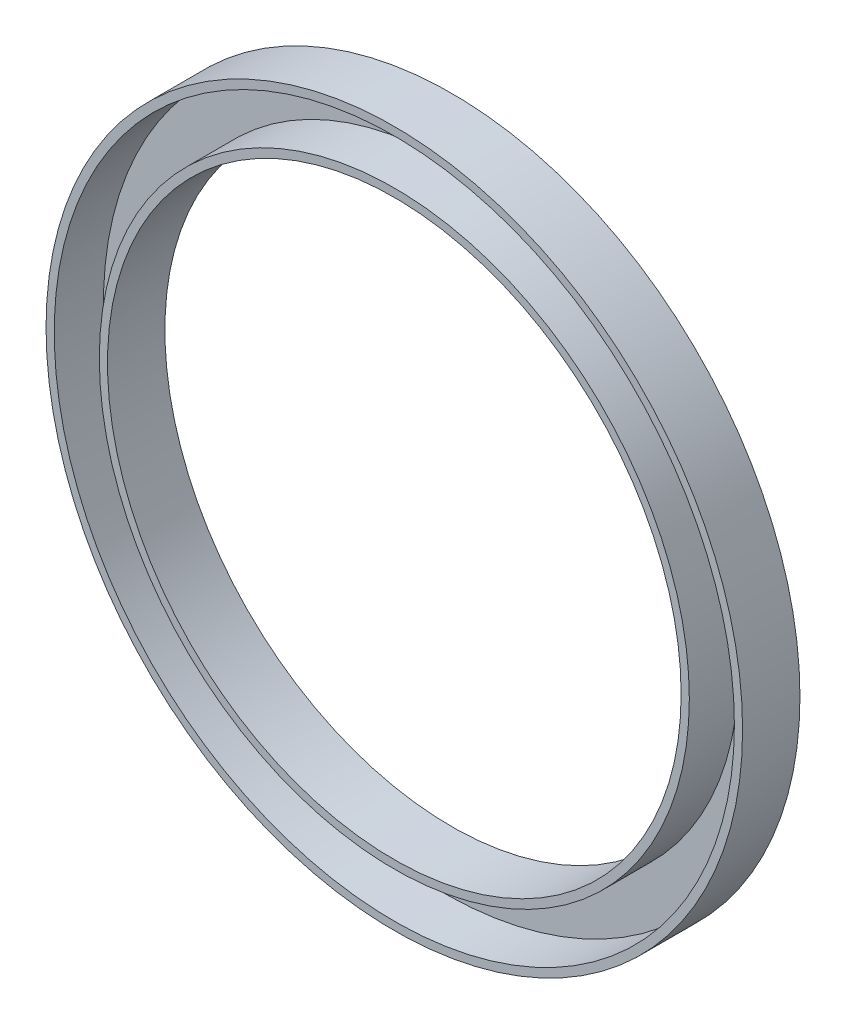
ISO-10303-21;
HEADER;
FILE_DESCRIPTION(('STEP AP214'),'2;1');
FILE_NAME('part.step','',(''),(''),'','','');
FILE_SCHEMA(('AUTOMOTIVE_DESIGN { 1 0 10303 214 1 1 1 1 }'));
ENDSEC;
DATA;
#1=APPLICATION_CONTEXT('core data for automotive mechanical design processes');
#2=APPLICATION_PROTOCOL_DEFINITION('international standard','automotive_design',2000,#1);
#3=PRODUCT_CONTEXT('',#1,'mechanical');
#4=PRODUCT('Part','Part','',(#3));
#5=PRODUCT_RELATED_PRODUCT_CATEGORY('part','',(#4));
#6=PRODUCT_DEFINITION_FORMATION('','',#4);
#7=PRODUCT_DEFINITION_CONTEXT('part definition',#1,'design');
#8=PRODUCT_DEFINITION('design','',#6,#7);
#9=PRODUCT_DEFINITION_SHAPE('','',#8);
#10=(LENGTH_UNIT() NAMED_UNIT(*) SI_UNIT(.MILLI.,.METRE.));
#11=(NAMED_UNIT(*) PLANE_ANGLE_UNIT() SI_UNIT($,.RADIAN.));
#12=(NAMED_UNIT(*) SI_UNIT($,.STERADIAN.) SOLID_ANGLE_UNIT());
#13=UNCERTAINTY_MEASURE_WITH_UNIT(LENGTH_MEASURE(1.E-05),#10,'distance_accuracy_value','');
#14=(GEOMETRIC_REPRESENTATION_CONTEXT(3) GLOBAL_UNCERTAINTY_ASSIGNED_CONTEXT((#13)) GLOBAL_UNIT_ASSIGNED_CONTEXT((#10,
#11,#12)) REPRESENTATION_CONTEXT('',''));
#15=CARTESIAN_POINT('',(0.,0.,0.));
#16=DIRECTION('',(0.,0.,1.));
#17=DIRECTION('',(1.,0.,0.));
#18=AXIS2_PLACEMENT_3D('',#15,#16,#17);
#19=CARTESIAN_POINT('',(0.,0.,14.));
#20=DIRECTION('',(0.,0.,1.));
#21=DIRECTION('',(1.,0.,0.));
#22=AXIS2_PLACEMENT_3D('',#19,#20,#21);
#23=PLANE('',#22);
#24=CARTESIAN_POINT('',(0.,0.,14.));
#25=DIRECTION('',(0.,0.,1.));
#26=DIRECTION('',(1.,0.,0.));
#27=AXIS2_PLACEMENT_3D('',#24,#25,#26);
#28=CIRCLE('',#27,70.);
#29=CARTESIAN_POINT('',(70.,0.,14.));
#30=VERTEX_POINT('',#29);
#31=EDGE_CURVE('E41',#30,#30,#28,.T.);
#32=ORIENTED_EDGE('',*,*,#31,.F.);
#33=EDGE_LOOP('',(#32));
#34=FACE_BOUND('',#33,.T.);
#35=CARTESIAN_POINT('',(0.,0.,14.));
#36=DIRECTION('',(0.,0.,1.));
#37=DIRECTION('',(1.,0.,0.));
#38=AXIS2_PLACEMENT_3D('',#35,#36,#37);
#39=CIRCLE('',#38,72.);
#40=CARTESIAN_POINT('',(72.,0.,14.));
#41=VERTEX_POINT('',#40);
#42=EDGE_CURVE('E49',#41,#41,#39,.T.);
#43=ORIENTED_EDGE('',*,*,#42,.T.);
#44=EDGE_LOOP('',(#43));
#45=FACE_BOUND('',#44,.T.);
#46=ADVANCED_FACE('F30',(#34,#45),#23,.T.);
#47=CARTESIAN_POINT('',(0.,0.,14.));
#48=DIRECTION('',(0.,0.,1.));
#49=DIRECTION('',(1.,0.,0.));
#50=AXIS2_PLACEMENT_3D('',#47,#48,#49);
#51=CIRCLE('',#50,83.);
#52=CARTESIAN_POINT('',(83.,0.,14.));
#53=VERTEX_POINT('',#52);
#54=EDGE_CURVE('E46',#53,#53,#51,.T.);
#55=ORIENTED_EDGE('',*,*,#54,.F.);
#56=EDGE_LOOP('',(#55));
#57=FACE_BOUND('',#56,.T.);
#58=CARTESIAN_POINT('',(0.,0.,14.));
#59=DIRECTION('',(0.,0.,1.));
#60=DIRECTION('',(1.,0.,0.));
#61=AXIS2_PLACEMENT_3D('',#58,#59,#60);
#62=CIRCLE('',#61,85.);
#63=CARTESIAN_POINT('',(85.,0.,14.));
#64=VERTEX_POINT('',#63);
#65=EDGE_CURVE('E10',#64,#64,#62,.T.);
#66=ORIENTED_EDGE('',*,*,#65,.T.);
#67=EDGE_LOOP('',(#66));
#68=FACE_BOUND('',#67,.T.);
#69=ADVANCED_FACE('F78',(#57,#68),#23,.T.);
#70=CARTESIAN_POINT('',(0.,0.,0.));
#71=DIRECTION('',(0.,0.,1.));
#72=DIRECTION('',(1.,0.,0.));
#73=AXIS2_PLACEMENT_3D('',#70,#71,#72);
#74=PLANE('',#73);
#75=CARTESIAN_POINT('',(0.,0.,0.));
#76=DIRECTION('',(0.,0.,1.));
#77=DIRECTION('',(1.,0.,0.));
#78=AXIS2_PLACEMENT_3D('',#75,#76,#77);
#79=CIRCLE('',#78,85.);
#80=CARTESIAN_POINT('',(85.,0.,0.));
#81=VERTEX_POINT('',#80);
#82=EDGE_CURVE('E34',#81,#81,#79,.T.);
#83=ORIENTED_EDGE('',*,*,#82,.F.);
#84=EDGE_LOOP('',(#83));
#85=FACE_BOUND('',#84,.T.);
#86=CARTESIAN_POINT('',(0.,0.,0.));
#87=DIRECTION('',(0.,0.,1.));
#88=DIRECTION('',(1.,0.,0.));
#89=AXIS2_PLACEMENT_3D('',#86,#87,#88);
#90=CIRCLE('',#89,70.);
#91=CARTESIAN_POINT('',(70.,0.,0.));
#92=VERTEX_POINT('',#91);
#93=EDGE_CURVE('E43',#92,#92,#90,.T.);
#94=ORIENTED_EDGE('',*,*,#93,.T.);
#95=EDGE_LOOP('',(#94));
#96=FACE_BOUND('',#95,.T.);
#97=ADVANCED_FACE('F84',(#85,#96),#74,.F.);
#98=CARTESIAN_POINT('',(0.,0.,14.));
#99=DIRECTION('',(0.,0.,-1.));
#100=DIRECTION('',(-1.,0.,0.));
#101=AXIS2_PLACEMENT_3D('',#98,#99,#100);
#102=CYLINDRICAL_SURFACE('',#101,85.);
#103=ORIENTED_EDGE('',*,*,#65,.F.);
#104=EDGE_LOOP('',(#103));
#105=FACE_BOUND('',#104,.T.);
#106=ORIENTED_EDGE('',*,*,#82,.T.);
#107=EDGE_LOOP('',(#106));
#108=FACE_BOUND('',#107,.T.);
#109=ADVANCED_FACE('F32',(#105,#108),#102,.T.);
#110=CARTESIAN_POINT('',(0.,0.,14.));
#111=DIRECTION('',(0.,0.,-1.));
#112=DIRECTION('',(-1.,0.,0.));
#113=AXIS2_PLACEMENT_3D('',#110,#111,#112);
#114=CYLINDRICAL_SURFACE('',#113,70.);
#115=ORIENTED_EDGE('',*,*,#31,.T.);
#116=EDGE_LOOP('',(#115));
#117=FACE_BOUND('',#116,.T.);
#118=ORIENTED_EDGE('',*,*,#93,.F.);
#119=EDGE_LOOP('',(#118));
#120=FACE_BOUND('',#119,.T.);
#121=ADVANCED_FACE('F75',(#117,#120),#114,.F.);
#122=CARTESIAN_POINT('',(0.,0.,2.));
#123=DIRECTION('',(0.,0.,1.));
#124=DIRECTION('',(1.,0.,0.));
#125=AXIS2_PLACEMENT_3D('',#122,#123,#124);
#126=PLANE('',#125);
#127=CARTESIAN_POINT('',(0.,0.,2.));
#128=DIRECTION('',(0.,0.,1.));
#129=DIRECTION('',(1.,0.,0.));
#130=AXIS2_PLACEMENT_3D('',#127,#128,#129);
#131=CIRCLE('',#130,83.);
#132=CARTESIAN_POINT('',(83.,0.,2.));
#133=VERTEX_POINT('',#132);
#134=EDGE_CURVE('E52',#133,#133,#131,.T.);
#135=ORIENTED_EDGE('',*,*,#134,.T.);
#136=EDGE_LOOP('',(#135));
#137=FACE_BOUND('',#136,.T.);
#138=CARTESIAN_POINT('',(0.,0.,2.));
#139=DIRECTION('',(0.,0.,1.));
#140=DIRECTION('',(1.,0.,0.));
#141=AXIS2_PLACEMENT_3D('',#138,#139,#140);
#142=CIRCLE('',#141,72.);
#143=CARTESIAN_POINT('',(72.,0.,2.));
#144=VERTEX_POINT('',#143);
#145=EDGE_CURVE('E53',#144,#144,#142,.T.);
#146=ORIENTED_EDGE('',*,*,#145,.F.);
#147=EDGE_LOOP('',(#146));
#148=FACE_BOUND('',#147,.T.);
#149=ADVANCED_FACE('F61',(#137,#148),#126,.T.);
#150=CARTESIAN_POINT('',(0.,0.,14.));
#151=DIRECTION('',(0.,0.,-1.));
#152=DIRECTION('',(-1.,0.,0.));
#153=AXIS2_PLACEMENT_3D('',#150,#151,#152);
#154=CYLINDRICAL_SURFACE('',#153,83.);
#155=ORIENTED_EDGE('',*,*,#54,.T.);
#156=EDGE_LOOP('',(#155));
#157=FACE_BOUND('',#156,.T.);
#158=ORIENTED_EDGE('',*,*,#134,.F.);
#159=EDGE_LOOP('',(#158));
#160=FACE_BOUND('',#159,.T.);
#161=ADVANCED_FACE('F64',(#157,#160),#154,.F.);
#162=CARTESIAN_POINT('',(0.,0.,14.));
#163=DIRECTION('',(0.,0.,-1.));
#164=DIRECTION('',(-1.,0.,0.));
#165=AXIS2_PLACEMENT_3D('',#162,#163,#164);
#166=CYLINDRICAL_SURFACE('',#165,72.);
#167=ORIENTED_EDGE('',*,*,#42,.F.);
#168=EDGE_LOOP('',(#167));
#169=FACE_BOUND('',#168,.T.);
#170=ORIENTED_EDGE('',*,*,#145,.T.);
#171=EDGE_LOOP('',(#170));
#172=FACE_BOUND('',#171,.T.);
#173=ADVANCED_FACE('F66',(#169,#172),#166,.T.);
#174=CLOSED_SHELL('',(#46,#69,#97,#109,#121,#149,#161,#173));
#175=MANIFOLD_SOLID_BREP('B2',#174);
#176=ADVANCED_BREP_SHAPE_REPRESENTATION('',(#18,#175),#14);
#177=SHAPE_DEFINITION_REPRESENTATION(#9,#176);
ENDSEC;
END-ISO-10303-21;
